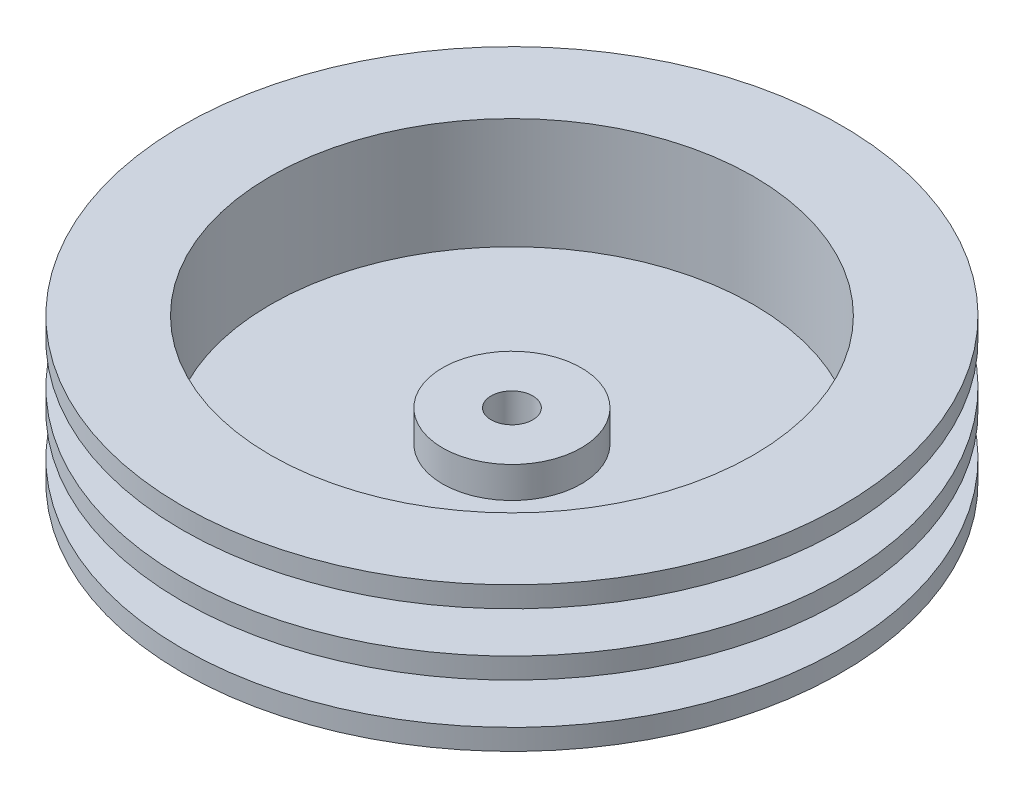
ISO-10303-21;
HEADER;
FILE_DESCRIPTION(('STEP AP214'),'2;1');
FILE_NAME('part.step','',(''),(''),'','','');
FILE_SCHEMA(('AUTOMOTIVE_DESIGN { 1 0 10303 214 1 1 1 1 }'));
ENDSEC;
DATA;
#1=APPLICATION_CONTEXT('core data for automotive mechanical design processes');
#2=APPLICATION_PROTOCOL_DEFINITION('international standard','automotive_design',2000,#1);
#3=PRODUCT_CONTEXT('',#1,'mechanical');
#4=PRODUCT('Part','Part','',(#3));
#5=PRODUCT_RELATED_PRODUCT_CATEGORY('part','',(#4));
#6=PRODUCT_DEFINITION_FORMATION('','',#4);
#7=PRODUCT_DEFINITION_CONTEXT('part definition',#1,'design');
#8=PRODUCT_DEFINITION('design','',#6,#7);
#9=PRODUCT_DEFINITION_SHAPE('','',#8);
#10=(LENGTH_UNIT() NAMED_UNIT(*) SI_UNIT(.MILLI.,.METRE.));
#11=(NAMED_UNIT(*) PLANE_ANGLE_UNIT() SI_UNIT($,.RADIAN.));
#12=(NAMED_UNIT(*) SI_UNIT($,.STERADIAN.) SOLID_ANGLE_UNIT());
#13=UNCERTAINTY_MEASURE_WITH_UNIT(LENGTH_MEASURE(1.E-05),#10,'distance_accuracy_value','');
#14=(GEOMETRIC_REPRESENTATION_CONTEXT(3) GLOBAL_UNCERTAINTY_ASSIGNED_CONTEXT((#13)) GLOBAL_UNIT_ASSIGNED_CONTEXT((#10,
#11,#12)) REPRESENTATION_CONTEXT('',''));
#15=CARTESIAN_POINT('',(0.,0.,0.));
#16=DIRECTION('',(0.,0.,1.));
#17=DIRECTION('',(1.,0.,0.));
#18=AXIS2_PLACEMENT_3D('',#15,#16,#17);
#19=CARTESIAN_POINT('',(0.,0.,0.));
#20=DIRECTION('',(0.,1.,0.));
#21=DIRECTION('',(0.,0.,1.));
#22=AXIS2_PLACEMENT_3D('',#19,#20,#21);
#23=PLANE('',#22);
#24=CARTESIAN_POINT('',(0.,0.,0.));
#25=DIRECTION('',(0.,1.,0.));
#26=DIRECTION('',(0.,0.,1.));
#27=AXIS2_PLACEMENT_3D('',#24,#25,#26);
#28=CIRCLE('',#27,1.5);
#29=CARTESIAN_POINT('',(0.,0.,1.5));
#30=VERTEX_POINT('',#29);
#31=EDGE_CURVE('E80',#30,#30,#28,.T.);
#32=ORIENTED_EDGE('',*,*,#31,.T.);
#33=EDGE_LOOP('',(#32));
#34=FACE_BOUND('',#33,.T.);
#35=CARTESIAN_POINT('',(0.,0.,0.));
#36=DIRECTION('',(0.,1.,0.));
#37=DIRECTION('',(0.,0.,1.));
#38=AXIS2_PLACEMENT_3D('',#35,#36,#37);
#39=CIRCLE('',#38,23.75);
#40=CARTESIAN_POINT('',(0.,0.,23.75));
#41=VERTEX_POINT('',#40);
#42=EDGE_CURVE('E10',#41,#41,#39,.T.);
#43=ORIENTED_EDGE('',*,*,#42,.F.);
#44=EDGE_LOOP('',(#43));
#45=FACE_BOUND('',#44,.T.);
#46=ADVANCED_FACE('F31',(#34,#45),#23,.F.);
#47=CARTESIAN_POINT('',(0.,4.65,0.));
#48=DIRECTION('',(0.,1.,0.));
#49=DIRECTION('',(0.,0.,1.));
#50=AXIS2_PLACEMENT_3D('',#47,#48,#49);
#51=CYLINDRICAL_SURFACE('',#50,23.75);
#52=CARTESIAN_POINT('',(0.,1.5,0.));
#53=DIRECTION('',(0.,1.,0.));
#54=DIRECTION('',(0.,0.,1.));
#55=AXIS2_PLACEMENT_3D('',#52,#53,#54);
#56=CIRCLE('',#55,23.75);
#57=CARTESIAN_POINT('',(0.,1.5,23.75));
#58=VERTEX_POINT('',#57);
#59=EDGE_CURVE('E37',#58,#58,#56,.T.);
#60=ORIENTED_EDGE('',*,*,#59,.F.);
#61=EDGE_LOOP('',(#60));
#62=FACE_BOUND('',#61,.T.);
#63=ORIENTED_EDGE('',*,*,#42,.T.);
#64=EDGE_LOOP('',(#63));
#65=FACE_BOUND('',#64,.T.);
#66=ADVANCED_FACE('F169',(#62,#65),#51,.T.);
#67=CARTESIAN_POINT('',(23.75,1.5,0.));
#68=DIRECTION('',(0.,-1.,0.));
#69=DIRECTION('',(0.,0.,-1.));
#70=AXIS2_PLACEMENT_3D('',#67,#68,#69);
#71=PLANE('',#70);
#72=CARTESIAN_POINT('',(0.,1.5,0.));
#73=DIRECTION('',(0.,1.,0.));
#74=DIRECTION('',(0.,0.,1.));
#75=AXIS2_PLACEMENT_3D('',#72,#73,#74);
#76=CIRCLE('',#75,18.9);
#77=CARTESIAN_POINT('',(0.,1.5,18.9));
#78=VERTEX_POINT('',#77);
#79=EDGE_CURVE('E41',#78,#78,#76,.T.);
#80=ORIENTED_EDGE('',*,*,#79,.F.);
#81=EDGE_LOOP('',(#80));
#82=FACE_BOUND('',#81,.T.);
#83=ORIENTED_EDGE('',*,*,#59,.T.);
#84=EDGE_LOOP('',(#83));
#85=FACE_BOUND('',#84,.T.);
#86=ADVANCED_FACE('F164',(#82,#85),#71,.F.);
#87=CARTESIAN_POINT('',(0.,4.65,0.));
#88=DIRECTION('',(0.,1.,0.));
#89=DIRECTION('',(0.,0.,1.));
#90=AXIS2_PLACEMENT_3D('',#87,#88,#89);
#91=CYLINDRICAL_SURFACE('',#90,18.9);
#92=CARTESIAN_POINT('',(0.,4.45,0.));
#93=DIRECTION('',(0.,1.,0.));
#94=DIRECTION('',(0.,0.,1.));
#95=AXIS2_PLACEMENT_3D('',#92,#93,#94);
#96=CIRCLE('',#95,18.9);
#97=CARTESIAN_POINT('',(0.,4.45,18.9));
#98=VERTEX_POINT('',#97);
#99=EDGE_CURVE('E45',#98,#98,#96,.T.);
#100=ORIENTED_EDGE('',*,*,#99,.F.);
#101=EDGE_LOOP('',(#100));
#102=FACE_BOUND('',#101,.T.);
#103=ORIENTED_EDGE('',*,*,#79,.T.);
#104=EDGE_LOOP('',(#103));
#105=FACE_BOUND('',#104,.T.);
#106=ADVANCED_FACE('F158',(#102,#105),#91,.T.);
#107=CARTESIAN_POINT('',(18.9,4.45,0.));
#108=DIRECTION('',(0.,1.,0.));
#109=DIRECTION('',(0.,0.,1.));
#110=AXIS2_PLACEMENT_3D('',#107,#108,#109);
#111=PLANE('',#110);
#112=CARTESIAN_POINT('',(0.,4.45,0.));
#113=DIRECTION('',(0.,1.,0.));
#114=DIRECTION('',(0.,0.,1.));
#115=AXIS2_PLACEMENT_3D('',#112,#113,#114);
#116=CIRCLE('',#115,23.75);
#117=CARTESIAN_POINT('',(0.,4.45,23.75));
#118=VERTEX_POINT('',#117);
#119=EDGE_CURVE('E50',#118,#118,#116,.T.);
#120=ORIENTED_EDGE('',*,*,#119,.F.);
#121=EDGE_LOOP('',(#120));
#122=FACE_BOUND('',#121,.T.);
#123=ORIENTED_EDGE('',*,*,#99,.T.);
#124=EDGE_LOOP('',(#123));
#125=FACE_BOUND('',#124,.T.);
#126=ADVANCED_FACE('F152',(#122,#125),#111,.F.);
#127=CARTESIAN_POINT('',(0.,4.65,0.));
#128=DIRECTION('',(0.,1.,0.));
#129=DIRECTION('',(0.,0.,1.));
#130=AXIS2_PLACEMENT_3D('',#127,#128,#129);
#131=CYLINDRICAL_SURFACE('',#130,23.75);
#132=CARTESIAN_POINT('',(0.,5.95,0.));
#133=DIRECTION('',(0.,1.,0.));
#134=DIRECTION('',(0.,0.,1.));
#135=AXIS2_PLACEMENT_3D('',#132,#133,#134);
#136=CIRCLE('',#135,23.75);
#137=CARTESIAN_POINT('',(0.,5.95,23.75));
#138=VERTEX_POINT('',#137);
#139=EDGE_CURVE('E53',#138,#138,#136,.T.);
#140=ORIENTED_EDGE('',*,*,#139,.F.);
#141=EDGE_LOOP('',(#140));
#142=FACE_BOUND('',#141,.T.);
#143=ORIENTED_EDGE('',*,*,#119,.T.);
#144=EDGE_LOOP('',(#143));
#145=FACE_BOUND('',#144,.T.);
#146=ADVANCED_FACE('F146',(#142,#145),#131,.T.);
#147=CARTESIAN_POINT('',(23.75,5.95,0.));
#148=DIRECTION('',(0.,-1.,0.));
#149=DIRECTION('',(0.,0.,-1.));
#150=AXIS2_PLACEMENT_3D('',#147,#148,#149);
#151=PLANE('',#150);
#152=CARTESIAN_POINT('',(0.,5.95,0.));
#153=DIRECTION('',(0.,1.,0.));
#154=DIRECTION('',(0.,0.,1.));
#155=AXIS2_PLACEMENT_3D('',#152,#153,#154);
#156=CIRCLE('',#155,18.9);
#157=CARTESIAN_POINT('',(0.,5.95,18.9));
#158=VERTEX_POINT('',#157);
#159=EDGE_CURVE('E56',#158,#158,#156,.T.);
#160=ORIENTED_EDGE('',*,*,#159,.F.);
#161=EDGE_LOOP('',(#160));
#162=FACE_BOUND('',#161,.T.);
#163=ORIENTED_EDGE('',*,*,#139,.T.);
#164=EDGE_LOOP('',(#163));
#165=FACE_BOUND('',#164,.T.);
#166=ADVANCED_FACE('F140',(#162,#165),#151,.F.);
#167=CARTESIAN_POINT('',(0.,4.65,0.));
#168=DIRECTION('',(0.,1.,0.));
#169=DIRECTION('',(0.,0.,1.));
#170=AXIS2_PLACEMENT_3D('',#167,#168,#169);
#171=CYLINDRICAL_SURFACE('',#170,18.9);
#172=CARTESIAN_POINT('',(0.,8.9,0.));
#173=DIRECTION('',(0.,1.,0.));
#174=DIRECTION('',(0.,0.,1.));
#175=AXIS2_PLACEMENT_3D('',#172,#173,#174);
#176=CIRCLE('',#175,18.9);
#177=CARTESIAN_POINT('',(0.,8.9,18.9));
#178=VERTEX_POINT('',#177);
#179=EDGE_CURVE('E59',#178,#178,#176,.T.);
#180=ORIENTED_EDGE('',*,*,#179,.F.);
#181=EDGE_LOOP('',(#180));
#182=FACE_BOUND('',#181,.T.);
#183=ORIENTED_EDGE('',*,*,#159,.T.);
#184=EDGE_LOOP('',(#183));
#185=FACE_BOUND('',#184,.T.);
#186=ADVANCED_FACE('F134',(#182,#185),#171,.T.);
#187=CARTESIAN_POINT('',(18.9,8.9,0.));
#188=DIRECTION('',(0.,1.,0.));
#189=DIRECTION('',(0.,0.,1.));
#190=AXIS2_PLACEMENT_3D('',#187,#188,#189);
#191=PLANE('',#190);
#192=CARTESIAN_POINT('',(0.,8.9,0.));
#193=DIRECTION('',(0.,1.,0.));
#194=DIRECTION('',(0.,0.,1.));
#195=AXIS2_PLACEMENT_3D('',#192,#193,#194);
#196=CIRCLE('',#195,23.75);
#197=CARTESIAN_POINT('',(0.,8.9,23.75));
#198=VERTEX_POINT('',#197);
#199=EDGE_CURVE('E62',#198,#198,#196,.T.);
#200=ORIENTED_EDGE('',*,*,#199,.F.);
#201=EDGE_LOOP('',(#200));
#202=FACE_BOUND('',#201,.T.);
#203=ORIENTED_EDGE('',*,*,#179,.T.);
#204=EDGE_LOOP('',(#203));
#205=FACE_BOUND('',#204,.T.);
#206=ADVANCED_FACE('F128',(#202,#205),#191,.F.);
#207=CARTESIAN_POINT('',(0.,4.65,0.));
#208=DIRECTION('',(0.,1.,0.));
#209=DIRECTION('',(0.,0.,1.));
#210=AXIS2_PLACEMENT_3D('',#207,#208,#209);
#211=CYLINDRICAL_SURFACE('',#210,23.75);
#212=CARTESIAN_POINT('',(0.,10.4,0.));
#213=DIRECTION('',(0.,1.,0.));
#214=DIRECTION('',(0.,0.,1.));
#215=AXIS2_PLACEMENT_3D('',#212,#213,#214);
#216=CIRCLE('',#215,23.75);
#217=CARTESIAN_POINT('',(0.,10.4,23.75));
#218=VERTEX_POINT('',#217);
#219=EDGE_CURVE('E65',#218,#218,#216,.T.);
#220=ORIENTED_EDGE('',*,*,#219,.F.);
#221=EDGE_LOOP('',(#220));
#222=FACE_BOUND('',#221,.T.);
#223=ORIENTED_EDGE('',*,*,#199,.T.);
#224=EDGE_LOOP('',(#223));
#225=FACE_BOUND('',#224,.T.);
#226=ADVANCED_FACE('F122',(#222,#225),#211,.T.);
#227=CARTESIAN_POINT('',(23.75,10.4,0.));
#228=DIRECTION('',(0.,-1.,0.));
#229=DIRECTION('',(0.,0.,-1.));
#230=AXIS2_PLACEMENT_3D('',#227,#228,#229);
#231=PLANE('',#230);
#232=CARTESIAN_POINT('',(0.,10.4,0.));
#233=DIRECTION('',(0.,1.,0.));
#234=DIRECTION('',(0.,0.,1.));
#235=AXIS2_PLACEMENT_3D('',#232,#233,#234);
#236=CIRCLE('',#235,17.4);
#237=CARTESIAN_POINT('',(0.,10.4,17.4));
#238=VERTEX_POINT('',#237);
#239=EDGE_CURVE('E68',#238,#238,#236,.T.);
#240=ORIENTED_EDGE('',*,*,#239,.F.);
#241=EDGE_LOOP('',(#240));
#242=FACE_BOUND('',#241,.T.);
#243=ORIENTED_EDGE('',*,*,#219,.T.);
#244=EDGE_LOOP('',(#243));
#245=FACE_BOUND('',#244,.T.);
#246=ADVANCED_FACE('F116',(#242,#245),#231,.F.);
#247=CARTESIAN_POINT('',(0.,4.65,0.));
#248=DIRECTION('',(0.,1.,0.));
#249=DIRECTION('',(0.,0.,1.));
#250=AXIS2_PLACEMENT_3D('',#247,#248,#249);
#251=CYLINDRICAL_SURFACE('',#250,17.4);
#252=CARTESIAN_POINT('',(0.,2.4,0.));
#253=DIRECTION('',(0.,1.,0.));
#254=DIRECTION('',(0.,0.,1.));
#255=AXIS2_PLACEMENT_3D('',#252,#253,#254);
#256=CIRCLE('',#255,17.4);
#257=CARTESIAN_POINT('',(0.,2.4,17.4));
#258=VERTEX_POINT('',#257);
#259=EDGE_CURVE('E71',#258,#258,#256,.T.);
#260=ORIENTED_EDGE('',*,*,#259,.F.);
#261=EDGE_LOOP('',(#260));
#262=FACE_BOUND('',#261,.T.);
#263=ORIENTED_EDGE('',*,*,#239,.T.);
#264=EDGE_LOOP('',(#263));
#265=FACE_BOUND('',#264,.T.);
#266=ADVANCED_FACE('F110',(#262,#265),#251,.F.);
#267=CARTESIAN_POINT('',(17.4,2.4,0.));
#268=DIRECTION('',(0.,-1.,0.));
#269=DIRECTION('',(0.,0.,-1.));
#270=AXIS2_PLACEMENT_3D('',#267,#268,#269);
#271=PLANE('',#270);
#272=CARTESIAN_POINT('',(0.,2.4,0.));
#273=DIRECTION('',(0.,1.,0.));
#274=DIRECTION('',(0.,0.,1.));
#275=AXIS2_PLACEMENT_3D('',#272,#273,#274);
#276=CIRCLE('',#275,5.);
#277=CARTESIAN_POINT('',(0.,2.4,5.));
#278=VERTEX_POINT('',#277);
#279=EDGE_CURVE('E74',#278,#278,#276,.T.);
#280=ORIENTED_EDGE('',*,*,#279,.F.);
#281=EDGE_LOOP('',(#280));
#282=FACE_BOUND('',#281,.T.);
#283=ORIENTED_EDGE('',*,*,#259,.T.);
#284=EDGE_LOOP('',(#283));
#285=FACE_BOUND('',#284,.T.);
#286=ADVANCED_FACE('F104',(#282,#285),#271,.F.);
#287=CARTESIAN_POINT('',(0.,4.65,0.));
#288=DIRECTION('',(0.,1.,0.));
#289=DIRECTION('',(0.,0.,1.));
#290=AXIS2_PLACEMENT_3D('',#287,#288,#289);
#291=CYLINDRICAL_SURFACE('',#290,5.);
#292=CARTESIAN_POINT('',(0.,4.65,0.));
#293=DIRECTION('',(0.,1.,0.));
#294=DIRECTION('',(0.,0.,1.));
#295=AXIS2_PLACEMENT_3D('',#292,#293,#294);
#296=CIRCLE('',#295,5.);
#297=CARTESIAN_POINT('',(0.,4.65,5.));
#298=VERTEX_POINT('',#297);
#299=EDGE_CURVE('E77',#298,#298,#296,.T.);
#300=ORIENTED_EDGE('',*,*,#299,.F.);
#301=EDGE_LOOP('',(#300));
#302=FACE_BOUND('',#301,.T.);
#303=ORIENTED_EDGE('',*,*,#279,.T.);
#304=EDGE_LOOP('',(#303));
#305=FACE_BOUND('',#304,.T.);
#306=ADVANCED_FACE('F98',(#302,#305),#291,.T.);
#307=CARTESIAN_POINT('',(5.,4.65,0.));
#308=DIRECTION('',(0.,-1.,0.));
#309=DIRECTION('',(0.,0.,-1.));
#310=AXIS2_PLACEMENT_3D('',#307,#308,#309);
#311=PLANE('',#310);
#312=CARTESIAN_POINT('',(0.,4.65,0.));
#313=DIRECTION('',(0.,1.,0.));
#314=DIRECTION('',(0.,0.,1.));
#315=AXIS2_PLACEMENT_3D('',#312,#313,#314);
#316=CIRCLE('',#315,1.5);
#317=CARTESIAN_POINT('',(0.,4.65,1.5));
#318=VERTEX_POINT('',#317);
#319=EDGE_CURVE('E81',#318,#318,#316,.T.);
#320=ORIENTED_EDGE('',*,*,#319,.F.);
#321=EDGE_LOOP('',(#320));
#322=FACE_BOUND('',#321,.T.);
#323=ORIENTED_EDGE('',*,*,#299,.T.);
#324=EDGE_LOOP('',(#323));
#325=FACE_BOUND('',#324,.T.);
#326=ADVANCED_FACE('F92',(#322,#325),#311,.F.);
#327=CARTESIAN_POINT('',(0.,0.,0.));
#328=DIRECTION('',(0.,1.,0.));
#329=DIRECTION('',(0.,0.,1.));
#330=AXIS2_PLACEMENT_3D('',#327,#328,#329);
#331=CYLINDRICAL_SURFACE('',#330,1.5);
#332=ORIENTED_EDGE('',*,*,#31,.F.);
#333=EDGE_LOOP('',(#332));
#334=FACE_BOUND('',#333,.T.);
#335=ORIENTED_EDGE('',*,*,#319,.T.);
#336=EDGE_LOOP('',(#335));
#337=FACE_BOUND('',#336,.T.);
#338=ADVANCED_FACE('F89',(#334,#337),#331,.F.);
#339=CLOSED_SHELL('',(#46,#66,#86,#106,#126,#146,#166,#186,#206,#226,#246,#266,#286,#306,#326,#338));
#340=MANIFOLD_SOLID_BREP('B2',#339);
#341=ADVANCED_BREP_SHAPE_REPRESENTATION('',(#18,#340),#14);
#342=SHAPE_DEFINITION_REPRESENTATION(#9,#341);
ENDSEC;
END-ISO-10303-21;
